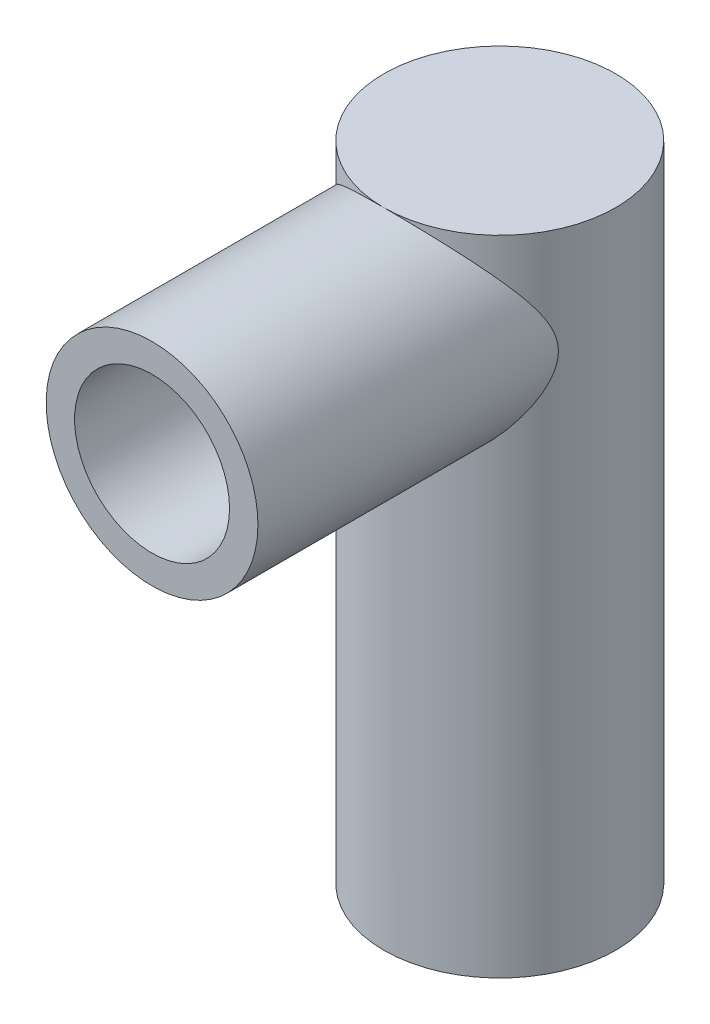
ISO-10303-21;
HEADER;
FILE_DESCRIPTION(('STEP AP214'),'2;1');
FILE_NAME('part.step','',(''),(''),'','','');
FILE_SCHEMA(('AUTOMOTIVE_DESIGN { 1 0 10303 214 1 1 1 1 }'));
ENDSEC;
DATA;
#1=APPLICATION_CONTEXT('core data for automotive mechanical design processes');
#2=APPLICATION_PROTOCOL_DEFINITION('international standard','automotive_design',2000,#1);
#3=PRODUCT_CONTEXT('',#1,'mechanical');
#4=PRODUCT('Part','Part','',(#3));
#5=PRODUCT_RELATED_PRODUCT_CATEGORY('part','',(#4));
#6=PRODUCT_DEFINITION_FORMATION('','',#4);
#7=PRODUCT_DEFINITION_CONTEXT('part definition',#1,'design');
#8=PRODUCT_DEFINITION('design','',#6,#7);
#9=PRODUCT_DEFINITION_SHAPE('','',#8);
#10=(LENGTH_UNIT() NAMED_UNIT(*) SI_UNIT(.MILLI.,.METRE.));
#11=(NAMED_UNIT(*) PLANE_ANGLE_UNIT() SI_UNIT($,.RADIAN.));
#12=(NAMED_UNIT(*) SI_UNIT($,.STERADIAN.) SOLID_ANGLE_UNIT());
#13=UNCERTAINTY_MEASURE_WITH_UNIT(LENGTH_MEASURE(1.E-05),#10,'distance_accuracy_value','');
#14=(GEOMETRIC_REPRESENTATION_CONTEXT(3) GLOBAL_UNCERTAINTY_ASSIGNED_CONTEXT((#13)) GLOBAL_UNIT_ASSIGNED_CONTEXT((#10,
#11,#12)) REPRESENTATION_CONTEXT('',''));
#15=CARTESIAN_POINT('',(0.,0.,0.));
#16=DIRECTION('',(0.,0.,1.));
#17=DIRECTION('',(1.,0.,0.));
#18=AXIS2_PLACEMENT_3D('',#15,#16,#17);
#19=CARTESIAN_POINT('',(0.,70.894,57.15));
#20=DIRECTION('',(0.,0.,-1.));
#21=DIRECTION('',(-1.,0.,0.));
#22=AXIS2_PLACEMENT_3D('',#19,#20,#21);
#23=CYLINDRICAL_SURFACE('',#22,13.97);
#24=CARTESIAN_POINT('',(-13.97,70.894,6.23931887308221));
#25=CARTESIAN_POINT('',(-13.9699990349045,70.6933079458446,6.23932299929133));
#26=CARTESIAN_POINT('',(-13.9656599230639,70.49259124547,6.24906420810483));
#27=CARTESIAN_POINT('',(-13.9484691382481,70.0933277395072,6.28733873444112));
#28=CARTESIAN_POINT('',(-13.9356152769912,69.8947815050636,6.31587688274692));
#29=CARTESIAN_POINT('',(-13.9017825528397,69.5009637799539,6.38999900006333));
#30=CARTESIAN_POINT('',(-13.8807765728528,69.3057055122673,6.43563984159803));
#31=CARTESIAN_POINT('',(-13.8312157986661,68.9201211566944,6.54147381367249));
#32=CARTESIAN_POINT('',(-13.80265695404,68.7297977755881,6.60167475096911));
#33=CARTESIAN_POINT('',(-13.7224468027855,68.2601341908785,6.7673188069534));
#34=CARTESIAN_POINT('',(-13.6664074032643,67.9842041999425,6.88028255375285));
#35=CARTESIAN_POINT('',(-13.540235069185,67.4443771535598,7.12538077910599));
#36=CARTESIAN_POINT('',(-13.4700922630546,67.1804886861115,7.25752866734243));
#37=CARTESIAN_POINT('',(-13.3165993575885,66.6629060609653,7.53548158689863));
#38=CARTESIAN_POINT('',(-13.2332071702305,66.4092477335749,7.6813295129726));
#39=CARTESIAN_POINT('',(-13.0540916520898,65.9118879159973,7.98193708838935));
#40=CARTESIAN_POINT('',(-12.958370246788,65.6681848788818,8.13669534410392));
#41=CARTESIAN_POINT('',(-12.7656850709909,65.2148927281736,8.43537042214138));
#42=CARTESIAN_POINT('',(-12.6699138226311,65.0044138878877,8.57871253495059));
#43=CARTESIAN_POINT('',(-12.4689297167072,64.5900572748894,8.86830857254741));
#44=CARTESIAN_POINT('',(-12.363715653151,64.3861803498805,9.0145628674039));
#45=CARTESIAN_POINT('',(-12.0338736142519,63.783671973665,9.45571481959765));
#46=CARTESIAN_POINT('',(-11.7951145717497,63.3943238645232,9.75289283446715));
#47=CARTESIAN_POINT('',(-11.2800648569595,62.6399561002252,10.3442734798289));
#48=CARTESIAN_POINT('',(-11.0038191621537,62.274908059854,10.6384792288098));
#49=CARTESIAN_POINT('',(-10.4128553263183,61.5695790731589,11.2175509220296));
#50=CARTESIAN_POINT('',(-10.0981575485708,61.2292851686762,11.5024217093339));
#51=CARTESIAN_POINT('',(-9.51294191750118,60.657407559541,11.9875013094165));
#52=CARTESIAN_POINT('',(-9.25100196079496,60.4198898741232,12.1910945184502));
#53=CARTESIAN_POINT('',(-8.70471424316807,59.9616658717928,12.5869654460559));
#54=CARTESIAN_POINT('',(-8.42036674850973,59.7409593551792,12.7792432990375));
#55=CARTESIAN_POINT('',(-7.82970587500243,59.3186720275089,13.1494115048295));
#56=CARTESIAN_POINT('',(-7.52342401914351,59.117064699549,13.3273217531013));
#57=CARTESIAN_POINT('',(-6.88896001952256,58.7350462140348,13.6660697780838));
#58=CARTESIAN_POINT('',(-6.56078274578813,58.5546303675053,13.82691133077));
#59=CARTESIAN_POINT('',(-5.95134791041924,58.2514579517419,14.0982042407134));
#60=CARTESIAN_POINT('',(-5.67385034765176,58.1243890638392,14.2122971847077));
#61=CARTESIAN_POINT('',(-5.10636305459066,57.8870595954507,14.4259115410679));
#62=CARTESIAN_POINT('',(-4.81637606980784,57.7767953447987,14.5254361350023));
#63=CARTESIAN_POINT('',(-4.22519351106887,57.5746084377894,14.7082776135257));
#64=CARTESIAN_POINT('',(-3.92400155751894,57.4826799170582,14.7915996800054));
#65=CARTESIAN_POINT('',(-3.31197231665064,57.318577373006,14.9405492852526));
#66=CARTESIAN_POINT('',(-3.00113492485017,57.2464035637567,15.0061766322712));
#67=CARTESIAN_POINT('',(-2.3698510460189,57.1226957676162,15.1187717301246));
#68=CARTESIAN_POINT('',(-2.04935500236181,57.0712998839121,15.1656146114938));
#69=CARTESIAN_POINT('',(-1.40325074318314,56.9908437079278,15.2389823035442));
#70=CARTESIAN_POINT('',(-1.07764251415582,56.9617834746657,15.2655070605382));
#71=CARTESIAN_POINT('',(-0.424258441281996,56.9266127009074,15.2976127666046));
#72=CARTESIAN_POINT('',(-0.0964833182359265,56.920494879137,15.3032003605413));
#73=CARTESIAN_POINT('',(0.558350037975512,56.9313228631496,15.2933138058846));
#74=CARTESIAN_POINT('',(0.885408324567752,56.948266887195,15.2778412843768));
#75=CARTESIAN_POINT('',(1.50201731442853,57.0019001877328,15.2289012444401));
#76=CARTESIAN_POINT('',(1.79193027018615,57.0363518730416,15.19747330253));
#77=CARTESIAN_POINT('',(2.36687096178558,57.1228954892666,15.1186011846928));
#78=CARTESIAN_POINT('',(2.65189910787412,57.174985931103,15.0711583607575));
#79=CARTESIAN_POINT('',(3.21537302852715,57.2960098830923,14.9610762829523));
#80=CARTESIAN_POINT('',(3.49381819791028,57.3649449352389,14.8984356378433));
#81=CARTESIAN_POINT('',(4.04264976154333,57.5186827305493,14.7589690142494));
#82=CARTESIAN_POINT('',(4.31303567720184,57.6034864138895,14.682142195273));
#83=CARTESIAN_POINT('',(4.85706505208104,57.7922225146107,14.5115116440867));
#84=CARTESIAN_POINT('',(5.1302635003312,57.8968670702838,14.4170793409401));
#85=CARTESIAN_POINT('',(5.6655917968504,58.1211288857026,14.2152364653039));
#86=CARTESIAN_POINT('',(5.92771730905223,58.2407519395289,14.1078208710937));
#87=CARTESIAN_POINT('',(6.44006814032002,58.4936757966613,13.8814249758194));
#88=CARTESIAN_POINT('',(6.69029383435268,58.6269761685726,13.7624450395113));
#89=CARTESIAN_POINT('',(7.17842295713455,58.9060801174144,13.5142610404366));
#90=CARTESIAN_POINT('',(7.41632374919119,59.0518863521784,13.3850548047581));
#91=CARTESIAN_POINT('',(8.00149654366098,59.4347050679606,13.0473231357992));
#92=CARTESIAN_POINT('',(8.34040787963759,59.6793207160433,12.8328515897596));
#93=CARTESIAN_POINT('',(8.98861401917824,60.1918227540461,12.3874775146371));
#94=CARTESIAN_POINT('',(9.29789524614355,60.4597197053211,12.1565675370863));
#95=CARTESIAN_POINT('',(9.88789792938826,61.016979456452,11.6817491259465));
#96=CARTESIAN_POINT('',(10.1685300342584,61.3064048225315,11.4378034362113));
#97=CARTESIAN_POINT('',(10.700607775205,61.9041172247172,10.9416310319059));
#98=CARTESIAN_POINT('',(10.9520591569081,62.2124005294153,10.6894059601193));
#99=CARTESIAN_POINT('',(11.4322433810181,62.8547532871643,10.1745119281479));
#100=CARTESIAN_POINT('',(11.6602644920768,63.1892707264755,9.91173872340489));
#101=CARTESIAN_POINT('',(12.0868403230258,63.8773634062895,9.38683668839746));
#102=CARTESIAN_POINT('',(12.2853805840231,64.2309478831038,9.12470823592411));
#103=CARTESIAN_POINT('',(12.652401057531,64.9574232618784,8.60851057295961));
#104=CARTESIAN_POINT('',(12.8209655303983,65.3302561197291,8.35442047696646));
#105=CARTESIAN_POINT('',(13.0510318070422,65.906607128051,7.9863398358275));
#106=CARTESIAN_POINT('',(13.1239011891281,66.1014995303588,7.86586398981518));
#107=CARTESIAN_POINT('',(13.2618403901971,66.4975809849005,7.63099509030381));
#108=CARTESIAN_POINT('',(13.3269120321535,66.6987685515123,7.51660061858041));
#109=CARTESIAN_POINT('',(13.4397490499573,67.0773341903262,7.31263435053581));
#110=CARTESIAN_POINT('',(13.4886458008829,67.25374953063,7.22191496307315));
#111=CARTESIAN_POINT('',(13.5802275115346,67.6118449916814,7.0481970760596));
#112=CARTESIAN_POINT('',(13.6229125738057,67.7935250254582,6.96519844905965));
#113=CARTESIAN_POINT('',(13.7409252824929,68.3465562604416,6.7310718400935));
#114=CARTESIAN_POINT('',(13.8064623521367,68.7267274345609,6.59434566130345));
#115=CARTESIAN_POINT('',(13.8773517858525,69.2794044492285,6.44294793430744));
#116=CARTESIAN_POINT('',(13.8955108509802,69.4436811867268,6.40360327376759));
#117=CARTESIAN_POINT('',(13.9261141195236,69.7751197070195,6.33677286044272));
#118=CARTESIAN_POINT('',(13.9385614254052,69.942279872296,6.30928067022369));
#119=CARTESIAN_POINT('',(13.9574420983199,70.2783696709952,6.26740360572586));
#120=CARTESIAN_POINT('',(13.963883149874,70.4472967630252,6.25300198371162));
#121=CARTESIAN_POINT('',(13.9706078218933,70.7858932258783,6.23796331931378));
#122=CARTESIAN_POINT('',(13.9708915015825,70.9555625895463,6.23732614453815));
#123=CARTESIAN_POINT('',(13.965290649411,71.2943105800472,6.24985635699657));
#124=CARTESIAN_POINT('',(13.9594052272351,71.4633891180793,6.26302573677077));
#125=CARTESIAN_POINT('',(13.9416317956472,71.799647509207,6.30248790460133));
#126=CARTESIAN_POINT('',(13.9297435493126,71.9668272870951,6.32878121063911));
#127=CARTESIAN_POINT('',(13.8854235804418,72.4645978052929,6.42574003543232));
#128=CARTESIAN_POINT('',(13.8443446744699,72.7909970750324,6.51446404041656));
#129=CARTESIAN_POINT('',(13.7501975164827,73.3773364188905,6.710574507875));
#130=CARTESIAN_POINT('',(13.700065853593,73.6396040457655,6.81276601134589));
#131=CARTESIAN_POINT('',(13.5869750511655,74.1534770184576,7.0356056904123));
#132=CARTESIAN_POINT('',(13.5240057987068,74.4050737682669,7.15626839807169));
#133=CARTESIAN_POINT('',(13.3860486902192,74.8990800830366,7.41112559514839));
#134=CARTESIAN_POINT('',(13.3110153074953,75.1414503662125,7.54537059928537));
#135=CARTESIAN_POINT('',(13.1498007605762,75.6169907054865,7.82294788418086));
#136=CARTESIAN_POINT('',(13.0636214748281,75.8501623032404,7.96627863162544));
#137=CARTESIAN_POINT('',(12.8865713297547,76.2930953358281,8.24938115496529));
#138=CARTESIAN_POINT('',(12.7963882794254,76.5033848707051,8.38876082599975));
#139=CARTESIAN_POINT('',(12.6068177014779,76.9173588249962,8.67104942844198));
#140=CARTESIAN_POINT('',(12.5074288256834,77.1210422710447,8.81395887452436));
#141=CARTESIAN_POINT('',(12.1954680104694,77.7230626205343,9.24589224966889));
#142=CARTESIAN_POINT('',(11.9691758776617,78.1121856822391,9.53800045910285));
#143=CARTESIAN_POINT('',(11.4802256592213,78.8669027555041,10.1212357208246));
#144=CARTESIAN_POINT('',(11.2175965168677,79.2325151576769,10.4123633669528));
#145=CARTESIAN_POINT('',(10.6552146418338,79.9400680166978,10.9871724245784));
#146=CARTESIAN_POINT('',(10.3554807439983,80.2820203473862,11.2708575260921));
#147=CARTESIAN_POINT('',(9.78736566186898,80.8688124794617,11.7646395830111));
#148=CARTESIAN_POINT('',(9.52633330757499,81.1186036326494,11.9773275348554));
#149=CARTESIAN_POINT('',(8.98066644374376,81.6010604245669,12.3917298988124));
#150=CARTESIAN_POINT('',(8.69603155505689,81.8337257880756,12.5934441345578));
#151=CARTESIAN_POINT('',(8.10355001584509,82.2795437374717,12.9826005029684));
#152=CARTESIAN_POINT('',(7.79574007483504,82.4927260461903,13.1700642996481));
#153=CARTESIAN_POINT('',(7.15683294309727,82.8974806342356,13.5278861869201));
#154=CARTESIAN_POINT('',(6.82574150744628,83.0890582238721,13.6982484798229));
#155=CARTESIAN_POINT('',(6.21386433938683,83.4096479959622,13.9845097217479));
#156=CARTESIAN_POINT('',(5.93732275078108,83.5433078893086,14.1042925277311));
#157=CARTESIAN_POINT('',(5.37113874487949,83.7939053788173,14.3294673119571));
#158=CARTESIAN_POINT('',(5.08149930380213,83.9108467490379,14.4348625378251));
#159=CARTESIAN_POINT('',(4.49031018602794,84.1264211100662,14.6295566566462));
#160=CARTESIAN_POINT('',(4.18876400357581,84.2250594245071,14.7188602298037));
#161=CARTESIAN_POINT('',(3.57525873784571,84.4025298210567,14.8797875580698));
#162=CARTESIAN_POINT('',(3.26329953216303,84.4813616702481,14.9514111052671));
#163=CARTESIAN_POINT('',(2.62877077407139,84.6183045640997,15.0759682749488));
#164=CARTESIAN_POINT('',(2.30614168484442,84.6762647670964,15.1287658139719));
#165=CARTESIAN_POINT('',(1.6549239812648,84.7695290492746,15.2137778959565));
#166=CARTESIAN_POINT('',(1.32633535120372,84.804833068729,15.2459923846561));
#167=CARTESIAN_POINT('',(0.666214559433561,84.8520267021112,15.2890652531612));
#168=CARTESIAN_POINT('',(0.334683642491865,84.8639257839041,15.2999322685351));
#169=CARTESIAN_POINT('',(-0.328370546910303,84.8640735029463,15.300067080311));
#170=CARTESIAN_POINT('',(-0.659893817392309,84.8523242600148,15.2893368126783));
#171=CARTESIAN_POINT('',(-1.2829391337522,84.8080699005231,15.2489466057829));
#172=CARTESIAN_POINT('',(-1.57478886743059,84.7780325995004,15.2215375365296));
#173=CARTESIAN_POINT('',(-2.1540403022961,84.7000275850749,15.1504204679439));
#174=CARTESIAN_POINT('',(-2.44144240358884,84.6520614944121,15.1067139437001));
#175=CARTESIAN_POINT('',(-3.01001677243048,84.5389528081197,15.0037758044157));
#176=CARTESIAN_POINT('',(-3.29118860093389,84.4738090061284,14.9445430989994));
#177=CARTESIAN_POINT('',(-3.84574779776392,84.3272940892694,14.8115342440016));
#178=CARTESIAN_POINT('',(-4.1191347222518,84.2459220512937,14.7377572671036));
#179=CARTESIAN_POINT('',(-4.66645342904576,84.064844459532,14.5739049430506));
#180=CARTESIAN_POINT('',(-4.94005625061586,83.9645881181296,14.483341781829));
#181=CARTESIAN_POINT('',(-5.47656758648338,83.7490275517364,14.289109414787));
#182=CARTESIAN_POINT('',(-5.7394719274151,83.6337175268894,14.1854351580313));
#183=CARTESIAN_POINT('',(-6.25371783270181,83.3893176314275,13.9663569586034));
#184=CARTESIAN_POINT('',(-6.50505910163642,83.2602274090272,13.8509527164879));
#185=CARTESIAN_POINT('',(-6.99569435300075,82.9894417116574,13.609740213072));
#186=CARTESIAN_POINT('',(-7.23498576203898,82.8477435618424,13.4839297444303));
#187=CARTESIAN_POINT('',(-7.82149986605615,82.476740454012,13.1559124533807));
#188=CARTESIAN_POINT('',(-8.1607163489449,82.2399524544599,12.9477775163057));
#189=CARTESIAN_POINT('',(-8.81036764315393,81.7432251354965,12.5147892874154));
#190=CARTESIAN_POINT('',(-9.12078962885483,81.4832755996035,12.2899286252303));
#191=CARTESIAN_POINT('',(-9.71369800543755,80.9422067229308,11.8269135462895));
#192=CARTESIAN_POINT('',(-9.99611071286226,80.6610348010579,11.5887265160866));
#193=CARTESIAN_POINT('',(-10.5324926136215,80.0800664084764,11.1034846031831));
#194=CARTESIAN_POINT('',(-10.78646669212,79.7802731503238,10.8564312531896));
#195=CARTESIAN_POINT('',(-11.2723154551286,79.1557243807223,10.3513549556829));
#196=CARTESIAN_POINT('',(-11.5035164553505,78.8305433809257,10.0932109648688));
#197=CARTESIAN_POINT('',(-11.9372589928314,78.1618522482085,9.57630978180017));
#198=CARTESIAN_POINT('',(-12.1397896951589,77.8183352530194,9.31755239509548));
#199=CARTESIAN_POINT('',(-12.5159336280631,77.1126821879888,8.80578362816667));
#200=CARTESIAN_POINT('',(-12.6895975404527,76.7505802432468,8.55276286550105));
#201=CARTESIAN_POINT('',(-12.9282142912617,76.1914616755003,8.18369350460564));
#202=CARTESIAN_POINT('',(-13.0040896083813,76.002479674507,8.06244452734775));
#203=CARTESIAN_POINT('',(-13.1483985076398,75.6186767534408,7.82488896097447));
#204=CARTESIAN_POINT('',(-13.2168334964091,75.4238569459489,7.70858144019447));
#205=CARTESIAN_POINT('',(-13.3430325694324,75.0369284884286,7.48791649715595));
#206=CARTESIAN_POINT('',(-13.4011425773351,74.8451069138751,7.38325551416584));
#207=CARTESIAN_POINT('',(-13.5099836670707,74.4552085919123,7.18215846139783));
#208=CARTESIAN_POINT('',(-13.5607171437861,74.257133900189,7.08571972638971));
#209=CARTESIAN_POINT('',(-13.6542452165362,73.8545852607794,6.90377003300457));
#210=CARTESIAN_POINT('',(-13.6970542941287,73.6501238004298,6.81823923158424));
#211=CARTESIAN_POINT('',(-13.7741744326788,73.2344625262871,6.66106313405949));
#212=CARTESIAN_POINT('',(-13.8084886759465,73.0232652694101,6.58941264034886));
#213=CARTESIAN_POINT('',(-13.8809334425964,72.4994848528254,6.43583018169465));
#214=CARTESIAN_POINT('',(-13.9140812641679,72.1832393793596,6.36328316900011));
#215=CARTESIAN_POINT('',(-13.9474951352894,71.7027932461201,6.28951908592709));
#216=CARTESIAN_POINT('',(-13.9559149592178,71.5417218913548,6.27077448840551));
#217=CARTESIAN_POINT('',(-13.9671669546382,71.2184388245657,6.24567454795453));
#218=CARTESIAN_POINT('',(-13.9700007801256,71.0562274643746,6.23931553770131));
#219=CARTESIAN_POINT('',(-13.97,70.894,6.23931887308221));
#220=B_SPLINE_CURVE_WITH_KNOTS('',3,(#24,#25,#26,#27,#28,#29,#30,#31,#32,#33,#34,#35,#36,#37,
#38,#39,#40,#41,#42,#43,#44,#45,#46,#47,#48,#49,#50,#51,#52,#53,#54,#55,#56,#57,#58,#59,#60,#61,
#62,#63,#64,#65,#66,#67,#68,#69,#70,#71,#72,#73,#74,#75,#76,#77,#78,#79,#80,#81,#82,#83,#84,#85,
#86,#87,#88,#89,#90,#91,#92,#93,#94,#95,#96,#97,#98,#99,#100,#101,#102,#103,#104,#105,#106,#107,
#108,#109,#110,#111,#112,#113,#114,#115,#116,#117,#118,#119,#120,#121,#122,#123,#124,#125,#126,
#127,#128,#129,#130,#131,#132,#133,#134,#135,#136,#137,#138,#139,#140,#141,#142,#143,#144,#145,
#146,#147,#148,#149,#150,#151,#152,#153,#154,#155,#156,#157,#158,#159,#160,#161,#162,#163,#164,
#165,#166,#167,#168,#169,#170,#171,#172,#173,#174,#175,#176,#177,#178,#179,#180,#181,#182,#183,
#184,#185,#186,#187,#188,#189,#190,#191,#192,#193,#194,#195,#196,#197,#198,#199,#200,#201,#202,
#203,#204,#205,#206,#207,#208,#209,#210,#211,#212,#213,#214,#215,#216,#217,#218,#219),
.UNSPECIFIED.,.T.,.F.,(4,2,2,2,2,2,2,2,2,2,2,2,2,2,2,2,2,2,2,2,2,2,2,2,2,2,2,2,2,2,2,2,2,2,2,2,
2,2,2,2,2,2,2,2,2,2,2,2,2,2,2,2,2,2,2,2,2,2,2,2,2,2,2,2,2,2,2,2,2,2,2,2,2,2,2,2,2,2,2,2,2,2,2,2,
2,2,2,2,2,2,2,2,2,2,2,2,2,4),(0.,0.60184732950395,1.20384939317971,1.80787135314529,
2.4122178952606,3.32074026810793,4.22990078196665,5.14200930881384,6.05397556200242,
6.8698975573846,7.68592390719164,9.31859275470844,10.9493197232156,12.5791868113989,
13.8022465247089,15.0252917069431,16.2466131592398,17.4676638623196,18.4442606920211,
19.4206439244227,20.3967143745975,21.3727954015346,22.3552614346383,23.3377300637293,
24.3198868585954,25.3019677772125,26.1818777425379,27.0617134435859,27.9416297169764,
28.8215981397046,29.7429581444688,30.6646756632163,31.586364119107,32.5082489463674,
33.9154929005175,35.323378604375,36.7355290835224,38.1474010395787,39.5940326823969,
41.0413714992237,42.4845753004211,43.2056465111986,43.9265488180925,44.539169268005,
45.1517796034018,46.3740621728356,46.8833288959861,47.3923186714921,47.9006563382792,
48.4089891156666,48.9173952649376,49.4258214818137,50.443927929116,51.3004902012934,
52.1577298632585,53.0182839043555,53.8786931026375,54.6821671935294,55.4857591383381,
57.0936370169367,58.7002414781655,60.3060337252065,61.562748501801,62.8194834700954,
64.0742680243511,65.3287434847938,66.3168753730361,67.3047838458552,68.2924045233083,
69.2800368142963,70.274669990589,71.2693057889631,72.2635391502108,73.2576833930425,
74.1406630816288,75.0235628708008,75.9065246810529,76.7895367309999,77.7040715320539,
78.6189597290712,79.5338712872411,80.4489774141778,81.8361860122288,83.224009561916,
84.6153922360581,86.0065355317904,87.430944874964,88.8558910946659,90.2783084694686,
90.9891433764705,91.6998436621152,92.3778727658365,93.0556812450804,93.7322385537653,
94.408542027683,95.3828961421685,95.8695376749671,96.356035093198),.UNSPECIFIED.);
#221=CARTESIAN_POINT('',(0.,84.864,15.3));
#222=VERTEX_POINT('',#221);
#223=EDGE_CURVE('E60',#222,#222,#220,.T.);
#224=ORIENTED_EDGE('',*,*,#223,.T.);
#225=EDGE_LOOP('',(#224));
#226=FACE_BOUND('',#225,.T.);
#227=CARTESIAN_POINT('',(0.,70.894,45.87875));
#228=DIRECTION('',(0.,0.,1.));
#229=DIRECTION('',(1.,0.,0.));
#230=AXIS2_PLACEMENT_3D('',#227,#228,#229);
#231=CIRCLE('',#230,13.97);
#232=CARTESIAN_POINT('',(13.97,70.894,45.87875));
#233=VERTEX_POINT('',#232);
#234=EDGE_CURVE('E74',#233,#233,#231,.T.);
#235=ORIENTED_EDGE('',*,*,#234,.F.);
#236=EDGE_LOOP('',(#235));
#237=FACE_BOUND('',#236,.T.);
#238=ADVANCED_FACE('F39',(#226,#237),#23,.T.);
#239=CARTESIAN_POINT('',(0.,84.864,0.));
#240=DIRECTION('',(0.,-1.,0.));
#241=DIRECTION('',(0.,0.,-1.));
#242=AXIS2_PLACEMENT_3D('',#239,#240,#241);
#243=CYLINDRICAL_SURFACE('',#242,15.3);
#244=CARTESIAN_POINT('',(0.,77.244,-15.3));
#245=CARTESIAN_POINT('',(-0.17020108696927,77.2439988642538,-15.2999990920196));
#246=CARTESIAN_POINT('',(-0.340460526205775,77.2371477773145,-15.2971521791933));
#247=CARTESIAN_POINT('',(-0.679767988707601,77.2098069112286,-15.2858354742696));
#248=CARTESIAN_POINT('',(-0.848815171932772,77.1893084538654,-15.2773621043775));
#249=CARTESIAN_POINT('',(-1.18472293758203,77.1348282263776,-15.2549932406706));
#250=CARTESIAN_POINT('',(-1.35157828110971,77.1008186880335,-15.2410865812408));
#251=CARTESIAN_POINT('',(-1.68161379710197,77.0196484546315,-15.2082113716892));
#252=CARTESIAN_POINT('',(-1.8447924380039,76.9724823846977,-15.1892407529102));
#253=CARTESIAN_POINT('',(-2.16569953267284,76.8656609575734,-15.1468096578067));
#254=CARTESIAN_POINT('',(-2.32344640671182,76.8060539418725,-15.1233665894188));
#255=CARTESIAN_POINT('',(-2.63322027770468,76.6747410784568,-15.0725181531865));
#256=CARTESIAN_POINT('',(-2.78524511011119,76.6030307074093,-15.0451113045264));
#257=CARTESIAN_POINT('',(-3.0825407571061,76.4481433142814,-14.9870229694531));
#258=CARTESIAN_POINT('',(-3.22781645972092,76.3649747694747,-14.9563439077254));
#259=CARTESIAN_POINT('',(-3.5109770125743,76.1877204217544,-14.8924192587394));
#260=CARTESIAN_POINT('',(-3.64885915586263,76.0936306596983,-14.8591727422024));
#261=CARTESIAN_POINT('',(-4.06241851504288,75.786893488202,-14.7536391434086));
#262=CARTESIAN_POINT('',(-4.32461095390844,75.5567337939374,-14.6782700240769));
#263=CARTESIAN_POINT('',(-4.80793156082827,75.0566085379132,-14.527151860378));
#264=CARTESIAN_POINT('',(-5.02903826380495,74.7866223003238,-14.4514026385324));
#265=CARTESIAN_POINT('',(-5.33067893794512,74.349408137002,-14.3417601911992));
#266=CARTESIAN_POINT('',(-5.42809554174861,74.1942905589338,-14.3050772454295));
#267=CARTESIAN_POINT('',(-5.60942075347103,73.875686364134,-14.2349513817511));
#268=CARTESIAN_POINT('',(-5.69333494746272,73.7122032453902,-14.2015071262579));
#269=CARTESIAN_POINT('',(-5.84693906859518,73.3778789528262,-14.1389599780242));
#270=CARTESIAN_POINT('',(-5.91662833919853,73.2070374398271,-14.1098572856809));
#271=CARTESIAN_POINT('',(-6.04105119210986,72.8592683282768,-14.0570364058761));
#272=CARTESIAN_POINT('',(-6.09579244335289,72.6823439031609,-14.0333154584236));
#273=CARTESIAN_POINT('',(-6.18750548440277,72.3322129539448,-13.9931113161949));
#274=CARTESIAN_POINT('',(-6.22519711157834,72.1592282848127,-13.9763381269793));
#275=CARTESIAN_POINT('',(-6.2860345660521,71.8103037272935,-13.9490818683851));
#276=CARTESIAN_POINT('',(-6.30918710001872,71.6343652399712,-13.9385958989063));
#277=CARTESIAN_POINT('',(-6.34068170919031,71.2809408903768,-13.9242973304225));
#278=CARTESIAN_POINT('',(-6.34902753340572,71.1034554312334,-13.9204830421731));
#279=CARTESIAN_POINT('',(-6.35081194093368,70.7483985150087,-13.9196692083957));
#280=CARTESIAN_POINT('',(-6.34425129972993,70.5708270628815,-13.9226693083605));
#281=CARTESIAN_POINT('',(-6.31737786586853,70.2305987558421,-13.9348817278203));
#282=CARTESIAN_POINT('',(-6.29815167656023,70.0678369571898,-13.9436029870861));
#283=CARTESIAN_POINT('',(-6.24725272626856,69.7446053059906,-13.9664817203578));
#284=CARTESIAN_POINT('',(-6.21557589289381,69.5841362211664,-13.9806409730031));
#285=CARTESIAN_POINT('',(-6.14010200173875,69.2666501733502,-14.0139517864198));
#286=CARTESIAN_POINT('',(-6.0963077221133,69.1096324279695,-14.0331022028137));
#287=CARTESIAN_POINT('',(-5.99697994741978,68.7999151296947,-14.0758357590523));
#288=CARTESIAN_POINT('',(-5.94144192747266,68.6472172670433,-14.0994206071002));
#289=CARTESIAN_POINT('',(-5.81782274837675,68.3439394292913,-14.1508837463484));
#290=CARTESIAN_POINT('',(-5.74950480614694,68.1934694980799,-14.1788411094997));
#291=CARTESIAN_POINT('',(-5.60162255517053,67.8987506929828,-14.2379128857794));
#292=CARTESIAN_POINT('',(-5.52205444732329,67.7545039421853,-14.2690283643751));
#293=CARTESIAN_POINT('',(-5.35221188262433,67.4729829844284,-14.333599692937));
#294=CARTESIAN_POINT('',(-5.26193586647934,67.3357097971316,-14.3670558834676));
#295=CARTESIAN_POINT('',(-5.07122322547216,67.0688070694978,-14.4354756577283));
#296=CARTESIAN_POINT('',(-4.9707860352691,66.9391779550925,-14.4704393252683));
#297=CARTESIAN_POINT('',(-4.75144119973856,66.6776234395729,-14.5440119691357));
#298=CARTESIAN_POINT('',(-4.6316906682017,66.5464204588987,-14.5826803738997));
#299=CARTESIAN_POINT('',(-4.38162362310597,66.2945037345725,-14.6597573748489));
#300=CARTESIAN_POINT('',(-4.25131017701035,66.1737869666776,-14.6981660429762));
#301=CARTESIAN_POINT('',(-3.98073033103422,65.9434576810584,-14.7737444666089));
#302=CARTESIAN_POINT('',(-3.84045795299572,65.8338519305512,-14.810913457947));
#303=CARTESIAN_POINT('',(-3.55087567742572,65.6266029996184,-14.8829947922287));
#304=CARTESIAN_POINT('',(-3.40156942612849,65.5289550403031,-14.9179080340222));
#305=CARTESIAN_POINT('',(-3.09116198285253,65.3441718069449,-14.9853434931213));
#306=CARTESIAN_POINT('',(-2.92986720381395,65.2573339364626,-15.0177911932989));
#307=CARTESIAN_POINT('',(-2.59978511467496,65.0976898436644,-15.0784368967111));
#308=CARTESIAN_POINT('',(-2.43100087729498,65.0248779311849,-15.1066366222818));
#309=CARTESIAN_POINT('',(-2.08710889375478,64.8939736533839,-15.1579744631841));
#310=CARTESIAN_POINT('',(-1.91200259556277,64.8358779416783,-15.1811137290728));
#311=CARTESIAN_POINT('',(-1.55678046810616,64.7350215816022,-15.2216418049075));
#312=CARTESIAN_POINT('',(-1.37666501707292,64.6922597787673,-15.2390310477554));
#313=CARTESIAN_POINT('',(-1.02434824630375,64.6247631026682,-15.2666285233793));
#314=CARTESIAN_POINT('',(-0.852361140458291,64.5990640318852,-15.2772194401226));
#315=CARTESIAN_POINT('',(-0.506604180036667,64.5618534365803,-15.2925894120526));
#316=CARTESIAN_POINT('',(-0.332834422493305,64.550341143936,-15.2973687818969));
#317=CARTESIAN_POINT('',(0.0150826605088501,64.5416345248441,-15.300981399432));
#318=CARTESIAN_POINT('',(0.189229885408586,64.5444367648089,-15.2998160730609));
#319=CARTESIAN_POINT('',(0.536563773077752,64.5643194262968,-15.2915752579233));
#320=CARTESIAN_POINT('',(0.709750456820028,64.5813995348259,-15.2844998987143));
#321=CARTESIAN_POINT('',(1.04530410469951,64.6284504943141,-15.265129478569));
#322=CARTESIAN_POINT('',(1.20778280885906,64.6577425916838,-15.2531096466568));
#323=CARTESIAN_POINT('',(1.52960751760713,64.7287778916113,-15.2242047724889));
#324=CARTESIAN_POINT('',(1.68895248351208,64.7705251507149,-15.2073181452181));
#325=CARTESIAN_POINT('',(2.00338444947609,64.866069664027,-15.169097837976));
#326=CARTESIAN_POINT('',(2.15847263424101,64.9198635265749,-15.1477654098145));
#327=CARTESIAN_POINT('',(2.46356485317441,65.0390718666862,-15.1011481156558));
#328=CARTESIAN_POINT('',(2.61356692504587,65.1044907699558,-15.0758617448162));
#329=CARTESIAN_POINT('',(2.91209816891724,65.2486043194922,-15.0210990035955));
#330=CARTESIAN_POINT('',(3.06044132720558,65.3276443713439,-14.9915179756963));
#331=CARTESIAN_POINT('',(3.35000528413952,65.496954046658,-14.9294809088512));
#332=CARTESIAN_POINT('',(3.49122362269026,65.5872275120588,-14.897023887386));
#333=CARTESIAN_POINT('',(3.76578071738297,65.7783980938761,-14.8299989708098));
#334=CARTESIAN_POINT('',(3.89911806424129,65.8792971014389,-14.7954307003976));
#335=CARTESIAN_POINT('',(4.1572280787577,66.0911020294846,-14.7249908214121));
#336=CARTESIAN_POINT('',(4.28200033462342,66.2020084305104,-14.6891191503003));
#337=CARTESIAN_POINT('',(4.53092242986186,66.4414558818794,-14.6143358007616));
#338=CARTESIAN_POINT('',(4.65439590516902,66.5706902380129,-14.5753894694189));
#339=CARTESIAN_POINT('',(4.89004795754336,66.8391481883759,-14.4980277936291));
#340=CARTESIAN_POINT('',(5.0022299716425,66.9783687206585,-14.4596122906924));
#341=CARTESIAN_POINT('',(5.21470934216463,67.2661472652883,-14.3843498352641));
#342=CARTESIAN_POINT('',(5.3149992508509,67.414711040891,-14.3475038748968));
#343=CARTESIAN_POINT('',(5.50287193927178,67.7201947225513,-14.2765011368773));
#344=CARTESIAN_POINT('',(5.59046004255228,67.8771110899767,-14.2423432353743));
#345=CARTESIAN_POINT('',(5.75344224282716,68.2007323912803,-14.1772957954947));
#346=CARTESIAN_POINT('',(5.82864389770897,68.3675452704018,-14.146460024985));
#347=CARTESIAN_POINT('',(5.96457164334448,68.7076989315943,-14.0896882110054));
#348=CARTESIAN_POINT('',(6.02530400376619,68.8810368484693,-14.0637500463759));
#349=CARTESIAN_POINT('',(6.13165856386715,69.2329651740744,-14.0177075569023));
#350=CARTESIAN_POINT('',(6.17728766307985,69.4115531437436,-13.9976005687577));
#351=CARTESIAN_POINT('',(6.2529198267526,69.7726147262316,-13.963979174982));
#352=CARTESIAN_POINT('',(6.28292434444212,69.9550879760399,-13.9504641562447));
#353=CARTESIAN_POINT('',(6.32523484724457,70.3082739626293,-13.9313278606806));
#354=CARTESIAN_POINT('',(6.33871964404251,70.4788179225486,-13.9251815979103));
#355=CARTESIAN_POINT('',(6.35187665591814,70.820545656517,-13.9191852573892));
#356=CARTESIAN_POINT('',(6.35154954910017,70.991729398743,-13.9193348705383));
#357=CARTESIAN_POINT('',(6.33708831581753,71.3333638268181,-13.9259244949887));
#358=CARTESIAN_POINT('',(6.3229561037829,71.5038146110186,-13.9323636340867));
#359=CARTESIAN_POINT('',(6.28105412004356,71.84268668115,-13.9513040996003));
#360=CARTESIAN_POINT('',(6.25328445286945,72.0111079826267,-13.9638053795497));
#361=CARTESIAN_POINT('',(6.18600949782627,72.3369754727794,-13.9937333117071));
#362=CARTESIAN_POINT('',(6.14710449053597,72.4945696031798,-14.0109062292315));
#363=CARTESIAN_POINT('',(6.0575247977999,72.8058403870187,-14.0498675294771));
#364=CARTESIAN_POINT('',(6.00684630118501,72.9595157540084,-14.0716574065423));
#365=CARTESIAN_POINT('',(5.8941609153809,73.2619960858597,-14.1192281287138));
#366=CARTESIAN_POINT('',(5.83215552159381,73.4108016905838,-14.1450084469247));
#367=CARTESIAN_POINT('',(5.69728468263066,73.7027976746267,-14.1998677845396));
#368=CARTESIAN_POINT('',(5.62441528330485,73.845985985362,-14.2289480040775));
#369=CARTESIAN_POINT('',(5.38094591553063,74.2826795624927,-14.3236494974718));
#370=CARTESIAN_POINT('',(5.19214728844515,74.5653092087366,-14.3937830724902));
#371=CARTESIAN_POINT('',(4.772593078742,75.0963144465615,-14.5382743950008));
#372=CARTESIAN_POINT('',(4.54182313182246,75.3446782596395,-14.6126335826617));
#373=CARTESIAN_POINT('',(4.15907978717465,75.6958219693115,-14.7245208779931));
#374=CARTESIAN_POINT('',(4.02014890661111,75.8127310392993,-14.7631483160706));
#375=CARTESIAN_POINT('',(3.73247783071676,76.0344328769145,-14.8384864140749));
#376=CARTESIAN_POINT('',(3.58374121356738,76.139230026254,-14.8751977645296));
#377=CARTESIAN_POINT('',(3.27718637347597,76.3360368220874,-14.9457289937711));
#378=CARTESIAN_POINT('',(3.11935981303582,76.4280344557098,-14.9795461449313));
#379=CARTESIAN_POINT('',(2.79581082012871,76.5983264743349,-15.0432911026617));
#380=CARTESIAN_POINT('',(2.63009206216969,76.6766271586257,-15.0732206954982));
#381=CARTESIAN_POINT('',(2.29457730384773,76.8176805648639,-15.1278991418159));
#382=CARTESIAN_POINT('',(2.12489142715701,76.8806654138004,-15.1527243272062));
#383=CARTESIAN_POINT('',(1.78020124357489,76.9920460534488,-15.1970738805128));
#384=CARTESIAN_POINT('',(1.60519950009708,77.0404487567664,-15.2166007596317));
#385=CARTESIAN_POINT('',(1.25160933024716,77.1220671319561,-15.2497518851129));
#386=CARTESIAN_POINT('',(1.07303093616626,77.1553203744822,-15.263390729344));
#387=CARTESIAN_POINT('',(0.713408546559201,77.2064075540624,-15.2844182596798));
#388=CARTESIAN_POINT('',(0.532366466530326,77.2242528446904,-15.2918115478267));
#389=CARTESIAN_POINT('',(0.292474764086531,77.2375311598774,-15.2973162490719));
#390=CARTESIAN_POINT('',(0.234012905516161,77.2399563308075,-15.2983221241531));
#391=CARTESIAN_POINT('',(0.117036330942129,77.2431909481169,-15.2996641565418));
#392=CARTESIAN_POINT('',(0.0585216148085101,77.2440003905128,-15.3000003121982));
#393=CARTESIAN_POINT('',(0.,77.244,-15.3));
#394=B_SPLINE_CURVE_WITH_KNOTS('',3,(#244,#245,#246,#247,#248,#249,#250,#251,#252,#253,#254,
#255,#256,#257,#258,#259,#260,#261,#262,#263,#264,#265,#266,#267,#268,#269,#270,#271,#272,#273,
#274,#275,#276,#277,#278,#279,#280,#281,#282,#283,#284,#285,#286,#287,#288,#289,#290,#291,#292,
#293,#294,#295,#296,#297,#298,#299,#300,#301,#302,#303,#304,#305,#306,#307,#308,#309,#310,#311,
#312,#313,#314,#315,#316,#317,#318,#319,#320,#321,#322,#323,#324,#325,#326,#327,#328,#329,#330,
#331,#332,#333,#334,#335,#336,#337,#338,#339,#340,#341,#342,#343,#344,#345,#346,#347,#348,#349,
#350,#351,#352,#353,#354,#355,#356,#357,#358,#359,#360,#361,#362,#363,#364,#365,#366,#367,#368,
#369,#370,#371,#372,#373,#374,#375,#376,#377,#378,#379,#380,#381,#382,#383,#384,#385,#386,#387,
#388,#389,#390,#391,#392,#393),.UNSPECIFIED.,.T.,.F.,(4,2,2,2,2,2,2,2,2,2,2,2,2,2,2,2,2,2,2,2,2,
2,2,2,2,2,2,2,2,2,2,2,2,2,2,2,2,2,2,2,2,2,2,2,2,2,2,2,2,2,2,2,2,2,2,2,2,2,2,2,2,2,2,2,2,2,2,2,2,
2,2,2,2,2,4),(0.,0.510543648577754,1.02141225686278,1.53333628881137,2.0454697656413,
2.5556491187331,3.06601956277548,3.57601441945846,4.08619473953429,5.15204392435369,
6.21844840171403,6.77827675675737,7.33787290677849,7.8974948785749,8.45682920005703,
8.98962637784861,9.52217760330624,10.0545939692834,10.5869826378323,11.0787818012628,
11.5707419577746,12.0625894163971,12.5546267309564,13.0568942747777,13.5593318376685,
14.0618426559092,14.5643814479156,15.1091501457869,15.6537612061061,16.1987019962483,
16.7434242869899,17.3008185642954,17.8579862349569,18.4150270947536,18.9720260070705,
19.4940122829419,20.0159702953841,20.5378031130703,21.0596244916338,21.5556582548574,
22.0518537489694,22.5479097169764,23.0441549419372,23.555607943554,24.0672363504048,
24.5789559718667,25.0907001785731,25.6388672841991,26.1868670242327,26.7352081705604,
27.2833188292954,27.8392733218807,28.3949864747427,28.9504454129572,29.5058526791615,
30.0187514627394,30.5316250652488,31.0444275548437,31.5572261138878,32.0463756171602,
32.5356836830674,33.0249271960617,33.5143492147028,34.5508167117699,35.5876396001815,
36.1439880073173,36.7001345108787,37.2567995095999,37.813207818645,38.3605681218285,
38.9076685413576,39.4534046657996,39.9987383125885,40.1742822272536,40.3498265746901),.UNSPECIFIED.);
#395=CARTESIAN_POINT('',(0.,77.244,-15.3));
#396=VERTEX_POINT('',#395);
#397=EDGE_CURVE('E43',#396,#396,#394,.T.);
#398=ORIENTED_EDGE('',*,*,#397,.T.);
#399=EDGE_LOOP('',(#398));
#400=FACE_BOUND('',#399,.T.);
#401=CARTESIAN_POINT('',(0.,0.,0.));
#402=DIRECTION('',(0.,1.,0.));
#403=DIRECTION('',(0.,0.,1.));
#404=AXIS2_PLACEMENT_3D('',#401,#402,#403);
#405=CIRCLE('',#404,15.3);
#406=CARTESIAN_POINT('',(0.,0.,15.3));
#407=VERTEX_POINT('',#406);
#408=EDGE_CURVE('E62',#407,#407,#405,.T.);
#409=ORIENTED_EDGE('',*,*,#408,.T.);
#410=EDGE_LOOP('',(#409));
#411=FACE_BOUND('',#410,.T.);
#412=CARTESIAN_POINT('',(0.,84.864,0.));
#413=DIRECTION('',(0.,1.,0.));
#414=DIRECTION('',(0.,0.,1.));
#415=AXIS2_PLACEMENT_3D('',#412,#413,#414);
#416=CIRCLE('',#415,15.3);
#417=EDGE_CURVE('E57',#222,#222,#416,.T.);
#418=ORIENTED_EDGE('',*,*,#417,.F.);
#419=ORIENTED_EDGE('',*,*,#223,.F.);
#420=EDGE_LOOP('',(#418,#419));
#421=FACE_BOUND('',#420,.T.);
#422=ADVANCED_FACE('F58',(#400,#411,#421),#243,.T.);
#423=CARTESIAN_POINT('',(0.,84.864,0.));
#424=DIRECTION('',(0.,1.,0.));
#425=DIRECTION('',(0.,0.,1.));
#426=AXIS2_PLACEMENT_3D('',#423,#424,#425);
#427=PLANE('',#426);
#428=ORIENTED_EDGE('',*,*,#417,.T.);
#429=EDGE_LOOP('',(#428));
#430=FACE_BOUND('',#429,.T.);
#431=ADVANCED_FACE('F82',(#430),#427,.T.);
#432=CARTESIAN_POINT('',(0.,0.,0.));
#433=DIRECTION('',(0.,1.,0.));
#434=DIRECTION('',(0.,0.,1.));
#435=AXIS2_PLACEMENT_3D('',#432,#433,#434);
#436=PLANE('',#435);
#437=CARTESIAN_POINT('',(0.,0.,0.));
#438=DIRECTION('',(0.,-1.,0.));
#439=DIRECTION('',(0.,0.,-1.));
#440=AXIS2_PLACEMENT_3D('',#437,#438,#439);
#441=CIRCLE('',#440,10.75);
#442=CARTESIAN_POINT('',(0.,0.,-10.75));
#443=VERTEX_POINT('',#442);
#444=EDGE_CURVE('E52',#443,#443,#441,.T.);
#445=ORIENTED_EDGE('',*,*,#444,.F.);
#446=EDGE_LOOP('',(#445));
#447=FACE_BOUND('',#446,.T.);
#448=ORIENTED_EDGE('',*,*,#408,.F.);
#449=EDGE_LOOP('',(#448));
#450=FACE_BOUND('',#449,.T.);
#451=ADVANCED_FACE('F85',(#447,#450),#436,.F.);
#452=CARTESIAN_POINT('',(0.,6.2,0.));
#453=DIRECTION('',(0.,-1.,0.));
#454=DIRECTION('',(0.,0.,-1.));
#455=AXIS2_PLACEMENT_3D('',#452,#453,#454);
#456=CYLINDRICAL_SURFACE('',#455,10.75);
#457=CARTESIAN_POINT('',(0.,6.2,0.));
#458=DIRECTION('',(0.,-1.,0.));
#459=DIRECTION('',(0.,0.,-1.));
#460=AXIS2_PLACEMENT_3D('',#457,#458,#459);
#461=CIRCLE('',#460,10.75);
#462=CARTESIAN_POINT('',(0.,6.2,-10.75));
#463=VERTEX_POINT('',#462);
#464=EDGE_CURVE('E11',#463,#463,#461,.T.);
#465=CARTESIAN_POINT('',(0.,6.2,-10.75));
#466=CARTESIAN_POINT('',(0.,6.13541666666667,-10.75));
#467=CARTESIAN_POINT('',(0.,6.07083333333333,-10.75));
#468=CARTESIAN_POINT('',(0.,5.94166666666667,-10.75));
#469=CARTESIAN_POINT('',(0.,5.87708333333333,-10.75));
#470=CARTESIAN_POINT('',(0.,5.74791666666667,-10.75));
#471=CARTESIAN_POINT('',(0.,5.68333333333333,-10.75));
#472=CARTESIAN_POINT('',(0.,5.55416666666667,-10.75));
#473=CARTESIAN_POINT('',(0.,5.48958333333333,-10.75));
#474=CARTESIAN_POINT('',(0.,5.36041666666667,-10.75));
#475=CARTESIAN_POINT('',(0.,5.29583333333333,-10.75));
#476=CARTESIAN_POINT('',(0.,5.16666666666667,-10.75));
#477=CARTESIAN_POINT('',(0.,5.10208333333333,-10.75));
#478=CARTESIAN_POINT('',(0.,4.97291666666667,-10.75));
#479=CARTESIAN_POINT('',(0.,4.90833333333333,-10.75));
#480=CARTESIAN_POINT('',(0.,4.77916666666667,-10.75));
#481=CARTESIAN_POINT('',(0.,4.71458333333333,-10.75));
#482=CARTESIAN_POINT('',(0.,4.58541666666667,-10.75));
#483=CARTESIAN_POINT('',(0.,4.52083333333333,-10.75));
#484=CARTESIAN_POINT('',(0.,4.39166666666667,-10.75));
#485=CARTESIAN_POINT('',(0.,4.32708333333333,-10.75));
#486=CARTESIAN_POINT('',(0.,4.19791666666667,-10.75));
#487=CARTESIAN_POINT('',(0.,4.13333333333333,-10.75));
#488=CARTESIAN_POINT('',(0.,4.00416666666667,-10.75));
#489=CARTESIAN_POINT('',(0.,3.93958333333333,-10.75));
#490=CARTESIAN_POINT('',(0.,3.81041666666667,-10.75));
#491=CARTESIAN_POINT('',(0.,3.74583333333333,-10.75));
#492=CARTESIAN_POINT('',(0.,3.61666666666667,-10.75));
#493=CARTESIAN_POINT('',(0.,3.55208333333333,-10.75));
#494=CARTESIAN_POINT('',(0.,3.42291666666667,-10.75));
#495=CARTESIAN_POINT('',(0.,3.35833333333333,-10.75));
#496=CARTESIAN_POINT('',(0.,3.22916666666667,-10.75));
#497=CARTESIAN_POINT('',(0.,3.16458333333333,-10.75));
#498=CARTESIAN_POINT('',(0.,3.03541666666667,-10.75));
#499=CARTESIAN_POINT('',(0.,2.97083333333333,-10.75));
#500=CARTESIAN_POINT('',(0.,2.84166666666667,-10.75));
#501=CARTESIAN_POINT('',(0.,2.77708333333333,-10.75));
#502=CARTESIAN_POINT('',(0.,2.64791666666667,-10.75));
#503=CARTESIAN_POINT('',(0.,2.58333333333333,-10.75));
#504=CARTESIAN_POINT('',(0.,2.45416666666667,-10.75));
#505=CARTESIAN_POINT('',(0.,2.38958333333333,-10.75));
#506=CARTESIAN_POINT('',(0.,2.26041666666667,-10.75));
#507=CARTESIAN_POINT('',(0.,2.19583333333333,-10.75));
#508=CARTESIAN_POINT('',(0.,2.06666666666667,-10.75));
#509=CARTESIAN_POINT('',(0.,2.00208333333333,-10.75));
#510=CARTESIAN_POINT('',(0.,1.87291666666667,-10.75));
#511=CARTESIAN_POINT('',(0.,1.80833333333333,-10.75));
#512=CARTESIAN_POINT('',(0.,1.67916666666667,-10.75));
#513=CARTESIAN_POINT('',(0.,1.61458333333333,-10.75));
#514=CARTESIAN_POINT('',(0.,1.48541666666667,-10.75));
#515=CARTESIAN_POINT('',(0.,1.42083333333333,-10.75));
#516=CARTESIAN_POINT('',(0.,1.29166666666667,-10.75));
#517=CARTESIAN_POINT('',(0.,1.22708333333333,-10.75));
#518=CARTESIAN_POINT('',(0.,1.09791666666667,-10.75));
#519=CARTESIAN_POINT('',(0.,1.03333333333333,-10.75));
#520=CARTESIAN_POINT('',(0.,0.904166666666667,-10.75));
#521=CARTESIAN_POINT('',(0.,0.839583333333333,-10.75));
#522=CARTESIAN_POINT('',(0.,0.710416666666666,-10.75));
#523=CARTESIAN_POINT('',(0.,0.645833333333333,-10.75));
#524=CARTESIAN_POINT('',(0.,0.516666666666667,-10.75));
#525=CARTESIAN_POINT('',(0.,0.452083333333333,-10.75));
#526=CARTESIAN_POINT('',(0.,0.322916666666667,-10.75));
#527=CARTESIAN_POINT('',(0.,0.258333333333334,-10.75));
#528=CARTESIAN_POINT('',(0.,0.129166666666667,-10.75));
#529=CARTESIAN_POINT('',(0.,0.0645833333333335,-10.75));
#530=CARTESIAN_POINT('',(0.,0.,-10.75));
#531=B_SPLINE_CURVE_WITH_KNOTS('',3,(#465,#466,#467,#468,#469,#470,#471,#472,#473,#474,#475,
#476,#477,#478,#479,#480,#481,#482,#483,#484,#485,#486,#487,#488,#489,#490,#491,#492,#493,#494,
#495,#496,#497,#498,#499,#500,#501,#502,#503,#504,#505,#506,#507,#508,#509,#510,#511,#512,#513,
#514,#515,#516,#517,#518,#519,#520,#521,#522,#523,#524,#525,#526,#527,#528,#529,#530),
.UNSPECIFIED.,.F.,.F.,(4,2,2,2,2,2,2,2,2,2,2,2,2,2,2,2,2,2,2,2,2,2,2,2,2,2,2,2,2,2,2,2,4),(0.,
0.193749999999999,0.3875,0.581249999999999,0.775,0.96875,1.1625,1.35625,1.55,1.74375,1.9375,
2.13125,2.325,2.51875,2.7125,2.90625,3.1,3.29375,3.4875,3.68125,3.875,4.06875,4.2625,4.45625,
4.65,4.84375,5.0375,5.23125,5.425,5.61875,5.8125,6.00625,6.2),.UNSPECIFIED.);
#532=EDGE_CURVE('BSEAM83',#463,#443,#531,.T.);
#533=ORIENTED_EDGE('',*,*,#464,.F.);
#534=ORIENTED_EDGE('',*,*,#444,.T.);
#535=ORIENTED_EDGE('',*,*,#532,.T.);
#536=ORIENTED_EDGE('',*,*,#532,.F.);
#537=EDGE_LOOP('',(#533,#535,#534,#536));
#538=FACE_BOUND('',#537,.T.);
#539=ADVANCED_FACE('F83',(#538),#456,.F.);
#540=CARTESIAN_POINT('',(0.,6.2,0.));
#541=DIRECTION('',(0.,-1.,0.));
#542=DIRECTION('',(0.,0.,-1.));
#543=AXIS2_PLACEMENT_3D('',#540,#541,#542);
#544=PLANE('',#543);
#545=ORIENTED_EDGE('',*,*,#464,.T.);
#546=EDGE_LOOP('',(#545));
#547=FACE_BOUND('',#546,.T.);
#548=ADVANCED_FACE('F41',(#547),#544,.T.);
#549=CARTESIAN_POINT('',(0.,70.894,45.87875));
#550=DIRECTION('',(0.,0.,1.));
#551=DIRECTION('',(1.,0.,0.));
#552=AXIS2_PLACEMENT_3D('',#549,#550,#551);
#553=PLANE('',#552);
#554=CARTESIAN_POINT('',(0.,70.894,45.87875));
#555=DIRECTION('',(0.,0.,1.));
#556=DIRECTION('',(1.,0.,0.));
#557=AXIS2_PLACEMENT_3D('',#554,#555,#556);
#558=CIRCLE('',#557,10.2235);
#559=CARTESIAN_POINT('',(10.2235,70.894,45.87875));
#560=VERTEX_POINT('',#559);
#561=EDGE_CURVE('E113',#560,#560,#558,.T.);
#562=ORIENTED_EDGE('',*,*,#561,.F.);
#563=EDGE_LOOP('',(#562));
#564=FACE_BOUND('',#563,.T.);
#565=ORIENTED_EDGE('',*,*,#234,.T.);
#566=EDGE_LOOP('',(#565));
#567=FACE_BOUND('',#566,.T.);
#568=ADVANCED_FACE('F91',(#564,#567),#553,.T.);
#569=CARTESIAN_POINT('',(0.,70.894,31.75));
#570=DIRECTION('',(0.,0.,1.));
#571=DIRECTION('',(1.,0.,0.));
#572=AXIS2_PLACEMENT_3D('',#569,#570,#571);
#573=CYLINDRICAL_SURFACE('',#572,10.2235);
#574=ORIENTED_EDGE('',*,*,#561,.T.);
#575=EDGE_LOOP('',(#574));
#576=FACE_BOUND('',#575,.T.);
#577=CARTESIAN_POINT('',(0.,70.894,4.06400000000001));
#578=DIRECTION('',(0.,0.,1.));
#579=DIRECTION('',(1.,0.,0.));
#580=AXIS2_PLACEMENT_3D('',#577,#578,#579);
#581=CIRCLE('',#580,10.2235);
#582=CARTESIAN_POINT('',(10.2235,70.894,4.06400000000001));
#583=VERTEX_POINT('',#582);
#584=EDGE_CURVE('E110',#583,#583,#581,.T.);
#585=ORIENTED_EDGE('',*,*,#584,.F.);
#586=EDGE_LOOP('',(#585));
#587=FACE_BOUND('',#586,.T.);
#588=ADVANCED_FACE('F126',(#576,#587),#573,.F.);
#589=CARTESIAN_POINT('',(0.,70.894,4.06400000000001));
#590=DIRECTION('',(0.,0.,1.));
#591=DIRECTION('',(1.,0.,0.));
#592=AXIS2_PLACEMENT_3D('',#589,#590,#591);
#593=PLANE('',#592);
#594=CARTESIAN_POINT('',(0.,70.894,4.06400000000001));
#595=DIRECTION('',(0.,0.,1.));
#596=DIRECTION('',(1.,0.,0.));
#597=AXIS2_PLACEMENT_3D('',#594,#595,#596);
#598=CIRCLE('',#597,6.35);
#599=CARTESIAN_POINT('',(6.35,70.894,4.06400000000001));
#600=VERTEX_POINT('',#599);
#601=EDGE_CURVE('E111',#600,#600,#598,.T.);
#602=ORIENTED_EDGE('',*,*,#601,.F.);
#603=EDGE_LOOP('',(#602));
#604=FACE_BOUND('',#603,.T.);
#605=ORIENTED_EDGE('',*,*,#584,.T.);
#606=EDGE_LOOP('',(#605));
#607=FACE_BOUND('',#606,.T.);
#608=ADVANCED_FACE('F131',(#604,#607),#593,.T.);
#609=CARTESIAN_POINT('',(0.,70.894,-107.442));
#610=DIRECTION('',(0.,0.,1.));
#611=DIRECTION('',(1.,0.,0.));
#612=AXIS2_PLACEMENT_3D('',#609,#610,#611);
#613=CYLINDRICAL_SURFACE('',#612,6.35);
#614=ORIENTED_EDGE('',*,*,#601,.T.);
#615=EDGE_LOOP('',(#614));
#616=FACE_BOUND('',#615,.T.);
#617=ORIENTED_EDGE('',*,*,#397,.F.);
#618=EDGE_LOOP('',(#617));
#619=FACE_BOUND('',#618,.T.);
#620=ADVANCED_FACE('F135',(#616,#619),#613,.F.);
#621=CLOSED_SHELL('',(#238,#422,#431,#451,#539,#548,#568,#588,#608,#620));
#622=MANIFOLD_SOLID_BREP('B2',#621);
#623=ADVANCED_BREP_SHAPE_REPRESENTATION('',(#18,#622),#14);
#624=SHAPE_DEFINITION_REPRESENTATION(#9,#623);
ENDSEC;
END-ISO-10303-21;
